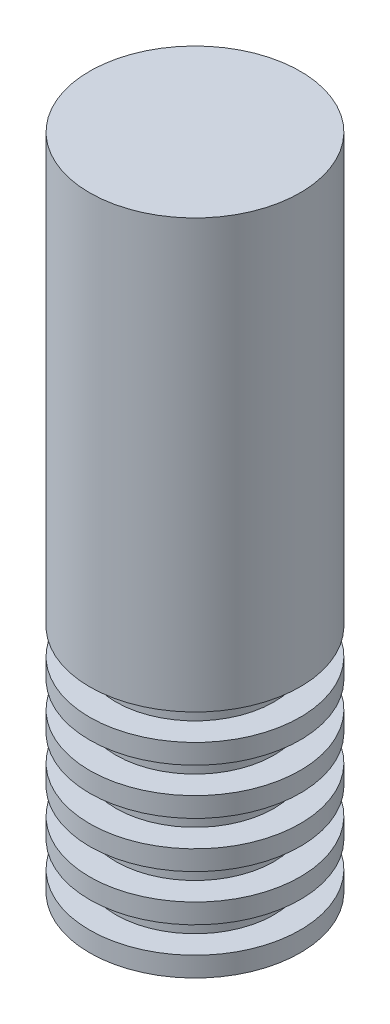
ISO-10303-21;
HEADER;
FILE_DESCRIPTION(('STEP AP214'),'2;1');
FILE_NAME('part.step','',(''),(''),'','','');
FILE_SCHEMA(('AUTOMOTIVE_DESIGN { 1 0 10303 214 1 1 1 1 }'));
ENDSEC;
DATA;
#1=APPLICATION_CONTEXT('core data for automotive mechanical design processes');
#2=APPLICATION_PROTOCOL_DEFINITION('international standard','automotive_design',2000,#1);
#3=PRODUCT_CONTEXT('',#1,'mechanical');
#4=PRODUCT('Part','Part','',(#3));
#5=PRODUCT_RELATED_PRODUCT_CATEGORY('part','',(#4));
#6=PRODUCT_DEFINITION_FORMATION('','',#4);
#7=PRODUCT_DEFINITION_CONTEXT('part definition',#1,'design');
#8=PRODUCT_DEFINITION('design','',#6,#7);
#9=PRODUCT_DEFINITION_SHAPE('','',#8);
#10=(LENGTH_UNIT() NAMED_UNIT(*) SI_UNIT(.MILLI.,.METRE.));
#11=(NAMED_UNIT(*) PLANE_ANGLE_UNIT() SI_UNIT($,.RADIAN.));
#12=(NAMED_UNIT(*) SI_UNIT($,.STERADIAN.) SOLID_ANGLE_UNIT());
#13=UNCERTAINTY_MEASURE_WITH_UNIT(LENGTH_MEASURE(1.E-05),#10,'distance_accuracy_value','');
#14=(GEOMETRIC_REPRESENTATION_CONTEXT(3) GLOBAL_UNCERTAINTY_ASSIGNED_CONTEXT((#13)) GLOBAL_UNIT_ASSIGNED_CONTEXT((#10,
#11,#12)) REPRESENTATION_CONTEXT('',''));
#15=CARTESIAN_POINT('',(0.,0.,0.));
#16=DIRECTION('',(0.,0.,1.));
#17=DIRECTION('',(1.,0.,0.));
#18=AXIS2_PLACEMENT_3D('',#15,#16,#17);
#19=CARTESIAN_POINT('',(0.,50.,0.));
#20=DIRECTION('',(0.,-1.,0.));
#21=DIRECTION('',(0.,0.,-1.));
#22=AXIS2_PLACEMENT_3D('',#19,#20,#21);
#23=PLANE('',#22);
#24=CARTESIAN_POINT('',(0.,50.,0.));
#25=DIRECTION('',(0.,1.,0.));
#26=DIRECTION('',(0.,0.,1.));
#27=AXIS2_PLACEMENT_3D('',#24,#25,#26);
#28=CIRCLE('',#27,8.);
#29=CARTESIAN_POINT('',(0.,50.,8.));
#30=VERTEX_POINT('',#29);
#31=EDGE_CURVE('E106',#30,#30,#28,.T.);
#32=ORIENTED_EDGE('',*,*,#31,.T.);
#33=EDGE_LOOP('',(#32));
#34=FACE_BOUND('',#33,.T.);
#35=ADVANCED_FACE('F30',(#34),#23,.F.);
#36=CARTESIAN_POINT('',(0.,-2.,0.));
#37=DIRECTION('',(0.,1.,0.));
#38=DIRECTION('',(0.,0.,1.));
#39=AXIS2_PLACEMENT_3D('',#36,#37,#38);
#40=PLANE('',#39);
#41=CARTESIAN_POINT('',(0.,-2.,0.));
#42=DIRECTION('',(0.,1.,0.));
#43=DIRECTION('',(0.,0.,1.));
#44=AXIS2_PLACEMENT_3D('',#41,#42,#43);
#45=CIRCLE('',#44,4.00000000000001);
#46=CARTESIAN_POINT('',(0.,-2.,4.00000000000001));
#47=VERTEX_POINT('',#46);
#48=EDGE_CURVE('E10',#47,#47,#45,.T.);
#49=ORIENTED_EDGE('',*,*,#48,.F.);
#50=EDGE_LOOP('',(#49));
#51=FACE_BOUND('',#50,.T.);
#52=ADVANCED_FACE('F244',(#51),#40,.F.);
#53=CARTESIAN_POINT('',(0.,68.7640449438202,0.));
#54=DIRECTION('',(0.,1.,0.));
#55=DIRECTION('',(0.,0.,1.));
#56=AXIS2_PLACEMENT_3D('',#53,#54,#55);
#57=CYLINDRICAL_SURFACE('',#56,4.00000000000001);
#58=CARTESIAN_POINT('',(0.,0.,0.));
#59=DIRECTION('',(0.,1.,0.));
#60=DIRECTION('',(0.,0.,1.));
#61=AXIS2_PLACEMENT_3D('',#58,#59,#60);
#62=CIRCLE('',#61,4.00000000000001);
#63=CARTESIAN_POINT('',(0.,0.,4.00000000000001));
#64=VERTEX_POINT('',#63);
#65=EDGE_CURVE('E36',#64,#64,#62,.T.);
#66=ORIENTED_EDGE('',*,*,#65,.F.);
#67=EDGE_LOOP('',(#66));
#68=FACE_BOUND('',#67,.T.);
#69=ORIENTED_EDGE('',*,*,#48,.T.);
#70=EDGE_LOOP('',(#69));
#71=FACE_BOUND('',#70,.T.);
#72=ADVANCED_FACE('F239',(#68,#71),#57,.T.);
#73=CARTESIAN_POINT('',(4.00000000000001,0.,0.));
#74=DIRECTION('',(0.,1.,0.));
#75=DIRECTION('',(0.,0.,1.));
#76=AXIS2_PLACEMENT_3D('',#73,#74,#75);
#77=PLANE('',#76);
#78=CARTESIAN_POINT('',(0.,0.,0.));
#79=DIRECTION('',(0.,1.,0.));
#80=DIRECTION('',(0.,0.,1.));
#81=AXIS2_PLACEMENT_3D('',#78,#79,#80);
#82=CIRCLE('',#81,8.00000000000001);
#83=CARTESIAN_POINT('',(0.,0.,8.00000000000001));
#84=VERTEX_POINT('',#83);
#85=EDGE_CURVE('E40',#84,#84,#82,.T.);
#86=ORIENTED_EDGE('',*,*,#85,.F.);
#87=EDGE_LOOP('',(#86));
#88=FACE_BOUND('',#87,.T.);
#89=ORIENTED_EDGE('',*,*,#65,.T.);
#90=EDGE_LOOP('',(#89));
#91=FACE_BOUND('',#90,.T.);
#92=ADVANCED_FACE('F234',(#88,#91),#77,.F.);
#93=CARTESIAN_POINT('',(0.,68.7640449438202,0.));
#94=DIRECTION('',(0.,1.,0.));
#95=DIRECTION('',(0.,0.,1.));
#96=AXIS2_PLACEMENT_3D('',#93,#94,#95);
#97=CYLINDRICAL_SURFACE('',#96,8.00000000000001);
#98=CARTESIAN_POINT('',(0.,1.5,0.));
#99=DIRECTION('',(0.,1.,0.));
#100=DIRECTION('',(0.,0.,1.));
#101=AXIS2_PLACEMENT_3D('',#98,#99,#100);
#102=CIRCLE('',#101,8.00000000000001);
#103=CARTESIAN_POINT('',(0.,1.5,8.00000000000001));
#104=VERTEX_POINT('',#103);
#105=EDGE_CURVE('E44',#104,#104,#102,.T.);
#106=ORIENTED_EDGE('',*,*,#105,.F.);
#107=EDGE_LOOP('',(#106));
#108=FACE_BOUND('',#107,.T.);
#109=ORIENTED_EDGE('',*,*,#85,.T.);
#110=EDGE_LOOP('',(#109));
#111=FACE_BOUND('',#110,.T.);
#112=ADVANCED_FACE('F228',(#108,#111),#97,.T.);
#113=CARTESIAN_POINT('',(8.00000000000001,1.5,0.));
#114=DIRECTION('',(0.,-1.,0.));
#115=DIRECTION('',(0.,0.,-1.));
#116=AXIS2_PLACEMENT_3D('',#113,#114,#115);
#117=PLANE('',#116);
#118=CARTESIAN_POINT('',(0.,1.5,0.));
#119=DIRECTION('',(0.,1.,0.));
#120=DIRECTION('',(0.,0.,1.));
#121=AXIS2_PLACEMENT_3D('',#118,#119,#120);
#122=CIRCLE('',#121,5.99999999999999);
#123=CARTESIAN_POINT('',(0.,1.5,5.99999999999999));
#124=VERTEX_POINT('',#123);
#125=EDGE_CURVE('E49',#124,#124,#122,.T.);
#126=ORIENTED_EDGE('',*,*,#125,.F.);
#127=EDGE_LOOP('',(#126));
#128=FACE_BOUND('',#127,.T.);
#129=ORIENTED_EDGE('',*,*,#105,.T.);
#130=EDGE_LOOP('',(#129));
#131=FACE_BOUND('',#130,.T.);
#132=ADVANCED_FACE('F222',(#128,#131),#117,.F.);
#133=CARTESIAN_POINT('',(0.,68.7640449438202,0.));
#134=DIRECTION('',(0.,1.,0.));
#135=DIRECTION('',(0.,0.,1.));
#136=AXIS2_PLACEMENT_3D('',#133,#134,#135);
#137=CYLINDRICAL_SURFACE('',#136,5.99999999999999);
#138=CARTESIAN_POINT('',(0.,3.5,0.));
#139=DIRECTION('',(0.,1.,0.));
#140=DIRECTION('',(0.,0.,1.));
#141=AXIS2_PLACEMENT_3D('',#138,#139,#140);
#142=CIRCLE('',#141,5.99999999999999);
#143=CARTESIAN_POINT('',(0.,3.5,5.99999999999999));
#144=VERTEX_POINT('',#143);
#145=EDGE_CURVE('E52',#144,#144,#142,.T.);
#146=ORIENTED_EDGE('',*,*,#145,.F.);
#147=EDGE_LOOP('',(#146));
#148=FACE_BOUND('',#147,.T.);
#149=ORIENTED_EDGE('',*,*,#125,.T.);
#150=EDGE_LOOP('',(#149));
#151=FACE_BOUND('',#150,.T.);
#152=ADVANCED_FACE('F216',(#148,#151),#137,.T.);
#153=CARTESIAN_POINT('',(8.00000000000001,3.5,0.));
#154=DIRECTION('',(0.,1.,0.));
#155=DIRECTION('',(0.,0.,1.));
#156=AXIS2_PLACEMENT_3D('',#153,#154,#155);
#157=PLANE('',#156);
#158=CARTESIAN_POINT('',(0.,3.5,0.));
#159=DIRECTION('',(0.,1.,0.));
#160=DIRECTION('',(0.,0.,1.));
#161=AXIS2_PLACEMENT_3D('',#158,#159,#160);
#162=CIRCLE('',#161,8.00000000000001);
#163=CARTESIAN_POINT('',(0.,3.5,8.00000000000001));
#164=VERTEX_POINT('',#163);
#165=EDGE_CURVE('E55',#164,#164,#162,.T.);
#166=ORIENTED_EDGE('',*,*,#165,.F.);
#167=EDGE_LOOP('',(#166));
#168=FACE_BOUND('',#167,.T.);
#169=ORIENTED_EDGE('',*,*,#145,.T.);
#170=EDGE_LOOP('',(#169));
#171=FACE_BOUND('',#170,.T.);
#172=ADVANCED_FACE('F210',(#168,#171),#157,.F.);
#173=CARTESIAN_POINT('',(0.,68.7640449438202,0.));
#174=DIRECTION('',(0.,1.,0.));
#175=DIRECTION('',(0.,0.,1.));
#176=AXIS2_PLACEMENT_3D('',#173,#174,#175);
#177=CYLINDRICAL_SURFACE('',#176,8.00000000000001);
#178=CARTESIAN_POINT('',(0.,5.,0.));
#179=DIRECTION('',(0.,1.,0.));
#180=DIRECTION('',(0.,0.,1.));
#181=AXIS2_PLACEMENT_3D('',#178,#179,#180);
#182=CIRCLE('',#181,8.00000000000001);
#183=CARTESIAN_POINT('',(0.,5.,8.00000000000001));
#184=VERTEX_POINT('',#183);
#185=EDGE_CURVE('E58',#184,#184,#182,.T.);
#186=ORIENTED_EDGE('',*,*,#185,.F.);
#187=EDGE_LOOP('',(#186));
#188=FACE_BOUND('',#187,.T.);
#189=ORIENTED_EDGE('',*,*,#165,.T.);
#190=EDGE_LOOP('',(#189));
#191=FACE_BOUND('',#190,.T.);
#192=ADVANCED_FACE('F204',(#188,#191),#177,.T.);
#193=CARTESIAN_POINT('',(8.00000000000001,5.,0.));
#194=DIRECTION('',(0.,-1.,0.));
#195=DIRECTION('',(0.,0.,-1.));
#196=AXIS2_PLACEMENT_3D('',#193,#194,#195);
#197=PLANE('',#196);
#198=CARTESIAN_POINT('',(0.,5.,0.));
#199=DIRECTION('',(0.,1.,0.));
#200=DIRECTION('',(0.,0.,1.));
#201=AXIS2_PLACEMENT_3D('',#198,#199,#200);
#202=CIRCLE('',#201,5.99999999999999);
#203=CARTESIAN_POINT('',(0.,5.,5.99999999999999));
#204=VERTEX_POINT('',#203);
#205=EDGE_CURVE('E61',#204,#204,#202,.T.);
#206=ORIENTED_EDGE('',*,*,#205,.F.);
#207=EDGE_LOOP('',(#206));
#208=FACE_BOUND('',#207,.T.);
#209=ORIENTED_EDGE('',*,*,#185,.T.);
#210=EDGE_LOOP('',(#209));
#211=FACE_BOUND('',#210,.T.);
#212=ADVANCED_FACE('F198',(#208,#211),#197,.F.);
#213=CARTESIAN_POINT('',(0.,68.7640449438202,0.));
#214=DIRECTION('',(0.,1.,0.));
#215=DIRECTION('',(0.,0.,1.));
#216=AXIS2_PLACEMENT_3D('',#213,#214,#215);
#217=CYLINDRICAL_SURFACE('',#216,5.99999999999999);
#218=CARTESIAN_POINT('',(0.,7.,0.));
#219=DIRECTION('',(0.,1.,0.));
#220=DIRECTION('',(0.,0.,1.));
#221=AXIS2_PLACEMENT_3D('',#218,#219,#220);
#222=CIRCLE('',#221,5.99999999999999);
#223=CARTESIAN_POINT('',(0.,7.,5.99999999999999));
#224=VERTEX_POINT('',#223);
#225=EDGE_CURVE('E64',#224,#224,#222,.T.);
#226=ORIENTED_EDGE('',*,*,#225,.F.);
#227=EDGE_LOOP('',(#226));
#228=FACE_BOUND('',#227,.T.);
#229=ORIENTED_EDGE('',*,*,#205,.T.);
#230=EDGE_LOOP('',(#229));
#231=FACE_BOUND('',#230,.T.);
#232=ADVANCED_FACE('F192',(#228,#231),#217,.T.);
#233=CARTESIAN_POINT('',(8.00000000000001,7.,0.));
#234=DIRECTION('',(0.,1.,0.));
#235=DIRECTION('',(0.,0.,1.));
#236=AXIS2_PLACEMENT_3D('',#233,#234,#235);
#237=PLANE('',#236);
#238=CARTESIAN_POINT('',(0.,7.,0.));
#239=DIRECTION('',(0.,1.,0.));
#240=DIRECTION('',(0.,0.,1.));
#241=AXIS2_PLACEMENT_3D('',#238,#239,#240);
#242=CIRCLE('',#241,8.00000000000001);
#243=CARTESIAN_POINT('',(0.,7.,8.00000000000001));
#244=VERTEX_POINT('',#243);
#245=EDGE_CURVE('E67',#244,#244,#242,.T.);
#246=ORIENTED_EDGE('',*,*,#245,.F.);
#247=EDGE_LOOP('',(#246));
#248=FACE_BOUND('',#247,.T.);
#249=ORIENTED_EDGE('',*,*,#225,.T.);
#250=EDGE_LOOP('',(#249));
#251=FACE_BOUND('',#250,.T.);
#252=ADVANCED_FACE('F186',(#248,#251),#237,.F.);
#253=CARTESIAN_POINT('',(0.,68.7640449438202,0.));
#254=DIRECTION('',(0.,1.,0.));
#255=DIRECTION('',(0.,0.,1.));
#256=AXIS2_PLACEMENT_3D('',#253,#254,#255);
#257=CYLINDRICAL_SURFACE('',#256,8.00000000000001);
#258=CARTESIAN_POINT('',(0.,8.5,0.));
#259=DIRECTION('',(0.,1.,0.));
#260=DIRECTION('',(0.,0.,1.));
#261=AXIS2_PLACEMENT_3D('',#258,#259,#260);
#262=CIRCLE('',#261,8.00000000000001);
#263=CARTESIAN_POINT('',(0.,8.5,8.00000000000001));
#264=VERTEX_POINT('',#263);
#265=EDGE_CURVE('E70',#264,#264,#262,.T.);
#266=ORIENTED_EDGE('',*,*,#265,.F.);
#267=EDGE_LOOP('',(#266));
#268=FACE_BOUND('',#267,.T.);
#269=ORIENTED_EDGE('',*,*,#245,.T.);
#270=EDGE_LOOP('',(#269));
#271=FACE_BOUND('',#270,.T.);
#272=ADVANCED_FACE('F180',(#268,#271),#257,.T.);
#273=CARTESIAN_POINT('',(8.00000000000001,8.5,0.));
#274=DIRECTION('',(0.,-1.,0.));
#275=DIRECTION('',(0.,0.,-1.));
#276=AXIS2_PLACEMENT_3D('',#273,#274,#275);
#277=PLANE('',#276);
#278=CARTESIAN_POINT('',(0.,8.5,0.));
#279=DIRECTION('',(0.,1.,0.));
#280=DIRECTION('',(0.,0.,1.));
#281=AXIS2_PLACEMENT_3D('',#278,#279,#280);
#282=CIRCLE('',#281,5.99999999999999);
#283=CARTESIAN_POINT('',(0.,8.5,5.99999999999999));
#284=VERTEX_POINT('',#283);
#285=EDGE_CURVE('E73',#284,#284,#282,.T.);
#286=ORIENTED_EDGE('',*,*,#285,.F.);
#287=EDGE_LOOP('',(#286));
#288=FACE_BOUND('',#287,.T.);
#289=ORIENTED_EDGE('',*,*,#265,.T.);
#290=EDGE_LOOP('',(#289));
#291=FACE_BOUND('',#290,.T.);
#292=ADVANCED_FACE('F174',(#288,#291),#277,.F.);
#293=CARTESIAN_POINT('',(0.,68.7640449438202,0.));
#294=DIRECTION('',(0.,1.,0.));
#295=DIRECTION('',(0.,0.,1.));
#296=AXIS2_PLACEMENT_3D('',#293,#294,#295);
#297=CYLINDRICAL_SURFACE('',#296,5.99999999999999);
#298=CARTESIAN_POINT('',(0.,10.5,0.));
#299=DIRECTION('',(0.,1.,0.));
#300=DIRECTION('',(0.,0.,1.));
#301=AXIS2_PLACEMENT_3D('',#298,#299,#300);
#302=CIRCLE('',#301,5.99999999999999);
#303=CARTESIAN_POINT('',(0.,10.5,5.99999999999999));
#304=VERTEX_POINT('',#303);
#305=EDGE_CURVE('E76',#304,#304,#302,.T.);
#306=ORIENTED_EDGE('',*,*,#305,.F.);
#307=EDGE_LOOP('',(#306));
#308=FACE_BOUND('',#307,.T.);
#309=ORIENTED_EDGE('',*,*,#285,.T.);
#310=EDGE_LOOP('',(#309));
#311=FACE_BOUND('',#310,.T.);
#312=ADVANCED_FACE('F168',(#308,#311),#297,.T.);
#313=CARTESIAN_POINT('',(8.00000000000001,10.5,0.));
#314=DIRECTION('',(0.,1.,0.));
#315=DIRECTION('',(0.,0.,1.));
#316=AXIS2_PLACEMENT_3D('',#313,#314,#315);
#317=PLANE('',#316);
#318=CARTESIAN_POINT('',(0.,10.5,0.));
#319=DIRECTION('',(0.,1.,0.));
#320=DIRECTION('',(0.,0.,1.));
#321=AXIS2_PLACEMENT_3D('',#318,#319,#320);
#322=CIRCLE('',#321,8.00000000000001);
#323=CARTESIAN_POINT('',(0.,10.5,8.00000000000001));
#324=VERTEX_POINT('',#323);
#325=EDGE_CURVE('E79',#324,#324,#322,.T.);
#326=ORIENTED_EDGE('',*,*,#325,.F.);
#327=EDGE_LOOP('',(#326));
#328=FACE_BOUND('',#327,.T.);
#329=ORIENTED_EDGE('',*,*,#305,.T.);
#330=EDGE_LOOP('',(#329));
#331=FACE_BOUND('',#330,.T.);
#332=ADVANCED_FACE('F162',(#328,#331),#317,.F.);
#333=CARTESIAN_POINT('',(0.,68.7640449438202,0.));
#334=DIRECTION('',(0.,1.,0.));
#335=DIRECTION('',(0.,0.,1.));
#336=AXIS2_PLACEMENT_3D('',#333,#334,#335);
#337=CYLINDRICAL_SURFACE('',#336,8.00000000000001);
#338=CARTESIAN_POINT('',(0.,12.,0.));
#339=DIRECTION('',(0.,1.,0.));
#340=DIRECTION('',(0.,0.,1.));
#341=AXIS2_PLACEMENT_3D('',#338,#339,#340);
#342=CIRCLE('',#341,8.00000000000001);
#343=CARTESIAN_POINT('',(0.,12.,8.00000000000001));
#344=VERTEX_POINT('',#343);
#345=EDGE_CURVE('E82',#344,#344,#342,.T.);
#346=ORIENTED_EDGE('',*,*,#345,.F.);
#347=EDGE_LOOP('',(#346));
#348=FACE_BOUND('',#347,.T.);
#349=ORIENTED_EDGE('',*,*,#325,.T.);
#350=EDGE_LOOP('',(#349));
#351=FACE_BOUND('',#350,.T.);
#352=ADVANCED_FACE('F156',(#348,#351),#337,.T.);
#353=CARTESIAN_POINT('',(8.00000000000001,12.,0.));
#354=DIRECTION('',(0.,-1.,0.));
#355=DIRECTION('',(0.,0.,-1.));
#356=AXIS2_PLACEMENT_3D('',#353,#354,#355);
#357=PLANE('',#356);
#358=CARTESIAN_POINT('',(0.,12.,0.));
#359=DIRECTION('',(0.,1.,0.));
#360=DIRECTION('',(0.,0.,1.));
#361=AXIS2_PLACEMENT_3D('',#358,#359,#360);
#362=CIRCLE('',#361,5.99999999999999);
#363=CARTESIAN_POINT('',(0.,12.,5.99999999999999));
#364=VERTEX_POINT('',#363);
#365=EDGE_CURVE('E85',#364,#364,#362,.T.);
#366=ORIENTED_EDGE('',*,*,#365,.F.);
#367=EDGE_LOOP('',(#366));
#368=FACE_BOUND('',#367,.T.);
#369=ORIENTED_EDGE('',*,*,#345,.T.);
#370=EDGE_LOOP('',(#369));
#371=FACE_BOUND('',#370,.T.);
#372=ADVANCED_FACE('F150',(#368,#371),#357,.F.);
#373=CARTESIAN_POINT('',(0.,68.7640449438202,0.));
#374=DIRECTION('',(0.,1.,0.));
#375=DIRECTION('',(0.,0.,1.));
#376=AXIS2_PLACEMENT_3D('',#373,#374,#375);
#377=CYLINDRICAL_SURFACE('',#376,5.99999999999999);
#378=CARTESIAN_POINT('',(0.,14.,0.));
#379=DIRECTION('',(0.,1.,0.));
#380=DIRECTION('',(0.,0.,1.));
#381=AXIS2_PLACEMENT_3D('',#378,#379,#380);
#382=CIRCLE('',#381,5.99999999999999);
#383=CARTESIAN_POINT('',(0.,14.,5.99999999999999));
#384=VERTEX_POINT('',#383);
#385=EDGE_CURVE('E88',#384,#384,#382,.T.);
#386=ORIENTED_EDGE('',*,*,#385,.F.);
#387=EDGE_LOOP('',(#386));
#388=FACE_BOUND('',#387,.T.);
#389=ORIENTED_EDGE('',*,*,#365,.T.);
#390=EDGE_LOOP('',(#389));
#391=FACE_BOUND('',#390,.T.);
#392=ADVANCED_FACE('F144',(#388,#391),#377,.T.);
#393=CARTESIAN_POINT('',(8.00000000000001,14.,0.));
#394=DIRECTION('',(0.,1.,0.));
#395=DIRECTION('',(0.,0.,1.));
#396=AXIS2_PLACEMENT_3D('',#393,#394,#395);
#397=PLANE('',#396);
#398=CARTESIAN_POINT('',(0.,14.,0.));
#399=DIRECTION('',(0.,1.,0.));
#400=DIRECTION('',(0.,0.,1.));
#401=AXIS2_PLACEMENT_3D('',#398,#399,#400);
#402=CIRCLE('',#401,8.00000000000001);
#403=CARTESIAN_POINT('',(0.,14.,8.00000000000001));
#404=VERTEX_POINT('',#403);
#405=EDGE_CURVE('E91',#404,#404,#402,.T.);
#406=ORIENTED_EDGE('',*,*,#405,.F.);
#407=EDGE_LOOP('',(#406));
#408=FACE_BOUND('',#407,.T.);
#409=ORIENTED_EDGE('',*,*,#385,.T.);
#410=EDGE_LOOP('',(#409));
#411=FACE_BOUND('',#410,.T.);
#412=ADVANCED_FACE('F138',(#408,#411),#397,.F.);
#413=CARTESIAN_POINT('',(0.,68.7640449438202,0.));
#414=DIRECTION('',(0.,1.,0.));
#415=DIRECTION('',(0.,0.,1.));
#416=AXIS2_PLACEMENT_3D('',#413,#414,#415);
#417=CYLINDRICAL_SURFACE('',#416,8.00000000000001);
#418=CARTESIAN_POINT('',(0.,15.5,0.));
#419=DIRECTION('',(0.,1.,0.));
#420=DIRECTION('',(0.,0.,1.));
#421=AXIS2_PLACEMENT_3D('',#418,#419,#420);
#422=CIRCLE('',#421,8.00000000000001);
#423=CARTESIAN_POINT('',(0.,15.5,8.00000000000001));
#424=VERTEX_POINT('',#423);
#425=EDGE_CURVE('E94',#424,#424,#422,.T.);
#426=ORIENTED_EDGE('',*,*,#425,.F.);
#427=EDGE_LOOP('',(#426));
#428=FACE_BOUND('',#427,.T.);
#429=ORIENTED_EDGE('',*,*,#405,.T.);
#430=EDGE_LOOP('',(#429));
#431=FACE_BOUND('',#430,.T.);
#432=ADVANCED_FACE('F132',(#428,#431),#417,.T.);
#433=CARTESIAN_POINT('',(8.00000000000001,15.5,0.));
#434=DIRECTION('',(0.,-1.,0.));
#435=DIRECTION('',(0.,0.,-1.));
#436=AXIS2_PLACEMENT_3D('',#433,#434,#435);
#437=PLANE('',#436);
#438=CARTESIAN_POINT('',(0.,15.5,0.));
#439=DIRECTION('',(0.,1.,0.));
#440=DIRECTION('',(0.,0.,1.));
#441=AXIS2_PLACEMENT_3D('',#438,#439,#440);
#442=CIRCLE('',#441,5.99999999999999);
#443=CARTESIAN_POINT('',(0.,15.5,5.99999999999999));
#444=VERTEX_POINT('',#443);
#445=EDGE_CURVE('E97',#444,#444,#442,.T.);
#446=ORIENTED_EDGE('',*,*,#445,.F.);
#447=EDGE_LOOP('',(#446));
#448=FACE_BOUND('',#447,.T.);
#449=ORIENTED_EDGE('',*,*,#425,.T.);
#450=EDGE_LOOP('',(#449));
#451=FACE_BOUND('',#450,.T.);
#452=ADVANCED_FACE('F126',(#448,#451),#437,.F.);
#453=CARTESIAN_POINT('',(0.,68.7640449438202,0.));
#454=DIRECTION('',(0.,1.,0.));
#455=DIRECTION('',(0.,0.,1.));
#456=AXIS2_PLACEMENT_3D('',#453,#454,#455);
#457=CYLINDRICAL_SURFACE('',#456,5.99999999999999);
#458=CARTESIAN_POINT('',(0.,17.5,0.));
#459=DIRECTION('',(0.,1.,0.));
#460=DIRECTION('',(0.,0.,1.));
#461=AXIS2_PLACEMENT_3D('',#458,#459,#460);
#462=CIRCLE('',#461,5.99999999999999);
#463=CARTESIAN_POINT('',(0.,17.5,5.99999999999999));
#464=VERTEX_POINT('',#463);
#465=EDGE_CURVE('E100',#464,#464,#462,.T.);
#466=ORIENTED_EDGE('',*,*,#465,.F.);
#467=EDGE_LOOP('',(#466));
#468=FACE_BOUND('',#467,.T.);
#469=ORIENTED_EDGE('',*,*,#445,.T.);
#470=EDGE_LOOP('',(#469));
#471=FACE_BOUND('',#470,.T.);
#472=ADVANCED_FACE('F120',(#468,#471),#457,.T.);
#473=CARTESIAN_POINT('',(8.00000000000001,17.5,0.));
#474=DIRECTION('',(0.,1.,0.));
#475=DIRECTION('',(0.,0.,1.));
#476=AXIS2_PLACEMENT_3D('',#473,#474,#475);
#477=PLANE('',#476);
#478=CARTESIAN_POINT('',(0.,17.5,0.));
#479=DIRECTION('',(0.,1.,0.));
#480=DIRECTION('',(0.,0.,1.));
#481=AXIS2_PLACEMENT_3D('',#478,#479,#480);
#482=CIRCLE('',#481,8.00000000000001);
#483=CARTESIAN_POINT('',(0.,17.5,8.00000000000001));
#484=VERTEX_POINT('',#483);
#485=EDGE_CURVE('E103',#484,#484,#482,.T.);
#486=ORIENTED_EDGE('',*,*,#485,.F.);
#487=EDGE_LOOP('',(#486));
#488=FACE_BOUND('',#487,.T.);
#489=ORIENTED_EDGE('',*,*,#465,.T.);
#490=EDGE_LOOP('',(#489));
#491=FACE_BOUND('',#490,.T.);
#492=ADVANCED_FACE('F114',(#488,#491),#477,.F.);
#493=CARTESIAN_POINT('',(0.,68.7640449438202,0.));
#494=DIRECTION('',(0.,1.,0.));
#495=DIRECTION('',(0.,0.,1.));
#496=AXIS2_PLACEMENT_3D('',#493,#494,#495);
#497=CYLINDRICAL_SURFACE('',#496,8.);
#498=ORIENTED_EDGE('',*,*,#31,.F.);
#499=EDGE_LOOP('',(#498));
#500=FACE_BOUND('',#499,.T.);
#501=ORIENTED_EDGE('',*,*,#485,.T.);
#502=EDGE_LOOP('',(#501));
#503=FACE_BOUND('',#502,.T.);
#504=ADVANCED_FACE('F111',(#500,#503),#497,.T.);
#505=CLOSED_SHELL('',(#35,#52,#72,#92,#112,#132,#152,#172,#192,#212,#232,#252,#272,#292,#312,
#332,#352,#372,#392,#412,#432,#452,#472,#492,#504));
#506=MANIFOLD_SOLID_BREP('B2',#505);
#507=ADVANCED_BREP_SHAPE_REPRESENTATION('',(#18,#506),#14);
#508=SHAPE_DEFINITION_REPRESENTATION(#9,#507);
ENDSEC;
END-ISO-10303-21;
